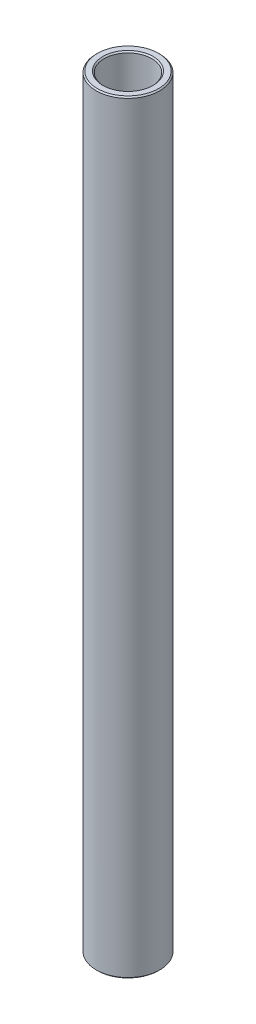
ISO-10303-21;
HEADER;
FILE_DESCRIPTION(('STEP AP214'),'2;1');
FILE_NAME('part.step','',(''),(''),'','','');
FILE_SCHEMA(('AUTOMOTIVE_DESIGN { 1 0 10303 214 1 1 1 1 }'));
ENDSEC;
DATA;
#1=APPLICATION_CONTEXT('core data for automotive mechanical design processes');
#2=APPLICATION_PROTOCOL_DEFINITION('international standard','automotive_design',2000,#1);
#3=PRODUCT_CONTEXT('',#1,'mechanical');
#4=PRODUCT('Part','Part','',(#3));
#5=PRODUCT_RELATED_PRODUCT_CATEGORY('part','',(#4));
#6=PRODUCT_DEFINITION_FORMATION('','',#4);
#7=PRODUCT_DEFINITION_CONTEXT('part definition',#1,'design');
#8=PRODUCT_DEFINITION('design','',#6,#7);
#9=PRODUCT_DEFINITION_SHAPE('','',#8);
#10=(LENGTH_UNIT() NAMED_UNIT(*) SI_UNIT(.MILLI.,.METRE.));
#11=(NAMED_UNIT(*) PLANE_ANGLE_UNIT() SI_UNIT($,.RADIAN.));
#12=(NAMED_UNIT(*) SI_UNIT($,.STERADIAN.) SOLID_ANGLE_UNIT());
#13=UNCERTAINTY_MEASURE_WITH_UNIT(LENGTH_MEASURE(1.E-05),#10,'distance_accuracy_value','');
#14=(GEOMETRIC_REPRESENTATION_CONTEXT(3) GLOBAL_UNCERTAINTY_ASSIGNED_CONTEXT((#13)) GLOBAL_UNIT_ASSIGNED_CONTEXT((#10,
#11,#12)) REPRESENTATION_CONTEXT('',''));
#15=CARTESIAN_POINT('',(0.,0.,0.));
#16=DIRECTION('',(0.,0.,1.));
#17=DIRECTION('',(1.,0.,0.));
#18=AXIS2_PLACEMENT_3D('',#15,#16,#17);
#19=CARTESIAN_POINT('',(0.,11.60859375,0.));
#20=DIRECTION('',(0.,1.,0.));
#21=DIRECTION('',(-1.,0.,0.));
#22=AXIS2_PLACEMENT_3D('',#19,#20,#21);
#23=CYLINDRICAL_SURFACE('',#22,4.7625);
#24=CARTESIAN_POINT('',(0.,-75.946,0.));
#25=DIRECTION('',(0.,1.,0.));
#26=DIRECTION('',(-1.,0.,0.));
#27=AXIS2_PLACEMENT_3D('',#24,#25,#26);
#28=CIRCLE('',#27,4.7625);
#29=CARTESIAN_POINT('',(-4.76250000000001,-75.946,0.));
#30=VERTEX_POINT('',#29);
#31=EDGE_CURVE('E75',#30,#30,#28,.F.);
#32=ORIENTED_EDGE('',*,*,#31,.T.);
#33=EDGE_LOOP('',(#32));
#34=FACE_BOUND('',#33,.T.);
#35=CARTESIAN_POINT('',(0.,75.9460000000001,0.));
#36=DIRECTION('',(0.,-1.,0.));
#37=DIRECTION('',(1.,0.,0.));
#38=AXIS2_PLACEMENT_3D('',#35,#36,#37);
#39=CIRCLE('',#38,4.7625);
#40=CARTESIAN_POINT('',(4.76250000000001,75.9460000000001,0.));
#41=VERTEX_POINT('',#40);
#42=EDGE_CURVE('E79',#41,#41,#39,.F.);
#43=ORIENTED_EDGE('',*,*,#42,.T.);
#44=EDGE_LOOP('',(#43));
#45=FACE_BOUND('',#44,.T.);
#46=ADVANCED_FACE('F51',(#34,#45),#23,.F.);
#47=CARTESIAN_POINT('',(4.76249999999999,76.2,0.));
#48=DIRECTION('',(0.,-1.,0.));
#49=DIRECTION('',(1.,0.,0.));
#50=AXIS2_PLACEMENT_3D('',#47,#48,#49);
#51=PLANE('',#50);
#52=CARTESIAN_POINT('',(0.,76.2,0.));
#53=DIRECTION('',(0.,-1.,0.));
#54=DIRECTION('',(1.,0.,0.));
#55=AXIS2_PLACEMENT_3D('',#52,#53,#54);
#56=CIRCLE('',#55,6.09599999999997);
#57=CARTESIAN_POINT('',(6.09599999999999,76.2,0.));
#58=VERTEX_POINT('',#57);
#59=EDGE_CURVE('E12',#58,#58,#56,.F.);
#60=ORIENTED_EDGE('',*,*,#59,.T.);
#61=EDGE_LOOP('',(#60));
#62=FACE_BOUND('',#61,.T.);
#63=CARTESIAN_POINT('',(0.,76.2,0.));
#64=DIRECTION('',(0.,-1.,0.));
#65=DIRECTION('',(1.,0.,0.));
#66=AXIS2_PLACEMENT_3D('',#63,#64,#65);
#67=CIRCLE('',#66,5.01649999999997);
#68=CARTESIAN_POINT('',(5.01649999999998,76.2,0.));
#69=VERTEX_POINT('',#68);
#70=EDGE_CURVE('E59',#69,#69,#67,.T.);
#71=ORIENTED_EDGE('',*,*,#70,.T.);
#72=EDGE_LOOP('',(#71));
#73=FACE_BOUND('',#72,.T.);
#74=ADVANCED_FACE('F105',(#62,#73),#51,.F.);
#75=CARTESIAN_POINT('',(0.,11.60859375,0.));
#76=DIRECTION('',(0.,1.,0.));
#77=DIRECTION('',(-1.,0.,0.));
#78=AXIS2_PLACEMENT_3D('',#75,#76,#77);
#79=CYLINDRICAL_SURFACE('',#78,6.35);
#80=CARTESIAN_POINT('',(0.,-75.9459999999999,0.));
#81=DIRECTION('',(0.,1.,0.));
#82=DIRECTION('',(-1.,0.,0.));
#83=AXIS2_PLACEMENT_3D('',#80,#81,#82);
#84=CIRCLE('',#83,6.35);
#85=CARTESIAN_POINT('',(-6.35000000000001,-75.9459999999999,0.));
#86=VERTEX_POINT('',#85);
#87=EDGE_CURVE('E64',#86,#86,#84,.T.);
#88=ORIENTED_EDGE('',*,*,#87,.T.);
#89=EDGE_LOOP('',(#88));
#90=FACE_BOUND('',#89,.T.);
#91=CARTESIAN_POINT('',(0.,75.946,0.));
#92=DIRECTION('',(0.,-1.,0.));
#93=DIRECTION('',(1.,0.,0.));
#94=AXIS2_PLACEMENT_3D('',#91,#92,#93);
#95=CIRCLE('',#94,6.35);
#96=CARTESIAN_POINT('',(6.35000000000001,75.946,0.));
#97=VERTEX_POINT('',#96);
#98=EDGE_CURVE('E69',#97,#97,#95,.T.);
#99=ORIENTED_EDGE('',*,*,#98,.T.);
#100=EDGE_LOOP('',(#99));
#101=FACE_BOUND('',#100,.T.);
#102=ADVANCED_FACE('F102',(#90,#101),#79,.T.);
#103=CARTESIAN_POINT('',(6.35000000000001,-76.2,0.));
#104=DIRECTION('',(0.,1.,0.));
#105=DIRECTION('',(-1.,0.,0.));
#106=AXIS2_PLACEMENT_3D('',#103,#104,#105);
#107=PLANE('',#106);
#108=CARTESIAN_POINT('',(0.,-76.2,0.));
#109=DIRECTION('',(0.,1.,0.));
#110=DIRECTION('',(-1.,0.,0.));
#111=AXIS2_PLACEMENT_3D('',#108,#109,#110);
#112=CIRCLE('',#111,5.01650000000002);
#113=CARTESIAN_POINT('',(-5.01650000000003,-76.2,0.));
#114=VERTEX_POINT('',#113);
#115=EDGE_CURVE('E83',#114,#114,#112,.T.);
#116=ORIENTED_EDGE('',*,*,#115,.T.);
#117=EDGE_LOOP('',(#116));
#118=FACE_BOUND('',#117,.T.);
#119=CARTESIAN_POINT('',(0.,-76.2,0.));
#120=DIRECTION('',(0.,1.,0.));
#121=DIRECTION('',(-1.,0.,0.));
#122=AXIS2_PLACEMENT_3D('',#119,#120,#121);
#123=CIRCLE('',#122,6.09599999999993);
#124=CARTESIAN_POINT('',(-6.09599999999994,-76.2,0.));
#125=VERTEX_POINT('',#124);
#126=EDGE_CURVE('E87',#125,#125,#123,.F.);
#127=ORIENTED_EDGE('',*,*,#126,.T.);
#128=EDGE_LOOP('',(#127));
#129=FACE_BOUND('',#128,.T.);
#130=ADVANCED_FACE('F92',(#118,#129),#107,.F.);
#131=CARTESIAN_POINT('',(0.,-76.2,0.));
#132=DIRECTION('',(0.,-1.,0.));
#133=DIRECTION('',(1.,0.,0.));
#134=AXIS2_PLACEMENT_3D('',#131,#132,#133);
#135=CONICAL_SURFACE('',#134,5.01650000000002,0.78539816339745);
#136=ORIENTED_EDGE('',*,*,#31,.F.);
#137=EDGE_LOOP('',(#136));
#138=FACE_BOUND('',#137,.T.);
#139=ORIENTED_EDGE('',*,*,#115,.F.);
#140=EDGE_LOOP('',(#139));
#141=FACE_BOUND('',#140,.T.);
#142=ADVANCED_FACE('F98',(#138,#141),#135,.F.);
#143=CARTESIAN_POINT('',(0.,-75.9459999999999,0.));
#144=DIRECTION('',(0.,1.,0.));
#145=DIRECTION('',(-1.,0.,0.));
#146=AXIS2_PLACEMENT_3D('',#143,#144,#145);
#147=CONICAL_SURFACE('',#146,6.35,0.785398163397431);
#148=ORIENTED_EDGE('',*,*,#126,.F.);
#149=EDGE_LOOP('',(#148));
#150=FACE_BOUND('',#149,.T.);
#151=ORIENTED_EDGE('',*,*,#87,.F.);
#152=EDGE_LOOP('',(#151));
#153=FACE_BOUND('',#152,.T.);
#154=ADVANCED_FACE('F94',(#150,#153),#147,.T.);
#155=CARTESIAN_POINT('',(0.,76.2,0.));
#156=DIRECTION('',(0.,-1.,0.));
#157=DIRECTION('',(1.,0.,0.));
#158=AXIS2_PLACEMENT_3D('',#155,#156,#157);
#159=CONICAL_SURFACE('',#158,6.09599999999998,0.785398163397458);
#160=ORIENTED_EDGE('',*,*,#98,.F.);
#161=EDGE_LOOP('',(#160));
#162=FACE_BOUND('',#161,.T.);
#163=ORIENTED_EDGE('',*,*,#59,.F.);
#164=EDGE_LOOP('',(#163));
#165=FACE_BOUND('',#164,.T.);
#166=ADVANCED_FACE('F97',(#162,#165),#159,.T.);
#167=CARTESIAN_POINT('',(0.,75.9460000000001,0.));
#168=DIRECTION('',(0.,1.,0.));
#169=DIRECTION('',(-1.,0.,0.));
#170=AXIS2_PLACEMENT_3D('',#167,#168,#169);
#171=CONICAL_SURFACE('',#170,4.7625,0.78539816339745);
#172=ORIENTED_EDGE('',*,*,#70,.F.);
#173=EDGE_LOOP('',(#172));
#174=FACE_BOUND('',#173,.T.);
#175=ORIENTED_EDGE('',*,*,#42,.F.);
#176=EDGE_LOOP('',(#175));
#177=FACE_BOUND('',#176,.T.);
#178=ADVANCED_FACE('F53',(#174,#177),#171,.F.);
#179=CLOSED_SHELL('',(#46,#74,#102,#130,#142,#154,#166,#178));
#180=MANIFOLD_SOLID_BREP('B2',#179);
#181=ADVANCED_BREP_SHAPE_REPRESENTATION('',(#18,#180),#14);
#182=SHAPE_DEFINITION_REPRESENTATION(#9,#181);
ENDSEC;
END-ISO-10303-21;
